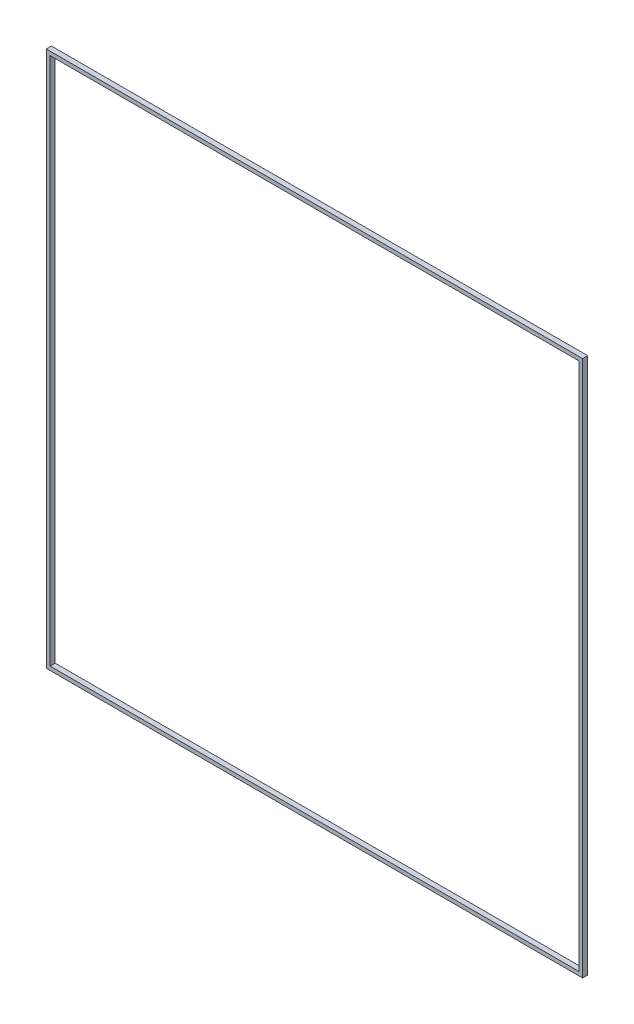
ISO-10303-21;
HEADER;
FILE_DESCRIPTION(('STEP AP214'),'2;1');
FILE_NAME('part.step','',(''),(''),'','','');
FILE_SCHEMA(('AUTOMOTIVE_DESIGN { 1 0 10303 214 1 1 1 1 }'));
ENDSEC;
DATA;
#1=APPLICATION_CONTEXT('core data for automotive mechanical design processes');
#2=APPLICATION_PROTOCOL_DEFINITION('international standard','automotive_design',2000,#1);
#3=PRODUCT_CONTEXT('',#1,'mechanical');
#4=PRODUCT('Part','Part','',(#3));
#5=PRODUCT_RELATED_PRODUCT_CATEGORY('part','',(#4));
#6=PRODUCT_DEFINITION_FORMATION('','',#4);
#7=PRODUCT_DEFINITION_CONTEXT('part definition',#1,'design');
#8=PRODUCT_DEFINITION('design','',#6,#7);
#9=PRODUCT_DEFINITION_SHAPE('','',#8);
#10=(LENGTH_UNIT() NAMED_UNIT(*) SI_UNIT(.MILLI.,.METRE.));
#11=(NAMED_UNIT(*) PLANE_ANGLE_UNIT() SI_UNIT($,.RADIAN.));
#12=(NAMED_UNIT(*) SI_UNIT($,.STERADIAN.) SOLID_ANGLE_UNIT());
#13=UNCERTAINTY_MEASURE_WITH_UNIT(LENGTH_MEASURE(1.E-05),#10,'distance_accuracy_value','');
#14=(GEOMETRIC_REPRESENTATION_CONTEXT(3) GLOBAL_UNCERTAINTY_ASSIGNED_CONTEXT((#13)) GLOBAL_UNIT_ASSIGNED_CONTEXT((#10,
#11,#12)) REPRESENTATION_CONTEXT('',''));
#15=CARTESIAN_POINT('',(0.,0.,0.));
#16=DIRECTION('',(0.,0.,1.));
#17=DIRECTION('',(1.,0.,0.));
#18=AXIS2_PLACEMENT_3D('',#15,#16,#17);
#19=CARTESIAN_POINT('',(0.,0.,2.));
#20=DIRECTION('',(0.,0.,-1.));
#21=DIRECTION('',(-1.,0.,0.));
#22=AXIS2_PLACEMENT_3D('',#19,#20,#21);
#23=PLANE('',#22);
#24=DIRECTION('',(0.,1.,0.));
#25=VECTOR('',#24,1.);
#26=CARTESIAN_POINT('',(105.,-105.,2.));
#27=LINE('',#26,#25);
#28=CARTESIAN_POINT('',(105.,-105.,2.));
#29=VERTEX_POINT('',#28);
#30=CARTESIAN_POINT('',(105.,105.,2.));
#31=VERTEX_POINT('',#30);
#32=EDGE_CURVE('E157',#29,#31,#27,.T.);
#33=ORIENTED_EDGE('',*,*,#32,.T.);
#34=DIRECTION('',(-1.,0.,0.));
#35=VECTOR('',#34,1.);
#36=CARTESIAN_POINT('',(-105.,105.,2.));
#37=LINE('',#36,#35);
#38=CARTESIAN_POINT('',(-105.,105.,2.));
#39=VERTEX_POINT('',#38);
#40=EDGE_CURVE('E161',#31,#39,#37,.T.);
#41=ORIENTED_EDGE('',*,*,#40,.T.);
#42=DIRECTION('',(0.,-1.,0.));
#43=VECTOR('',#42,1.);
#44=CARTESIAN_POINT('',(-105.,-105.,2.));
#45=LINE('',#44,#43);
#46=CARTESIAN_POINT('',(-105.,-105.,2.));
#47=VERTEX_POINT('',#46);
#48=EDGE_CURVE('E165',#39,#47,#45,.T.);
#49=ORIENTED_EDGE('',*,*,#48,.T.);
#50=DIRECTION('',(1.,0.,0.));
#51=VECTOR('',#50,1.);
#52=CARTESIAN_POINT('',(-105.,-105.,2.));
#53=LINE('',#52,#51);
#54=EDGE_CURVE('E168',#47,#29,#53,.T.);
#55=ORIENTED_EDGE('',*,*,#54,.T.);
#56=EDGE_LOOP('',(#33,#41,#49,#55));
#57=FACE_BOUND('',#56,.T.);
#58=DIRECTION('',(1.,0.,0.));
#59=VECTOR('',#58,1.);
#60=CARTESIAN_POINT('',(-103.5,103.5,2.));
#61=LINE('',#60,#59);
#62=CARTESIAN_POINT('',(-103.5,103.5,2.));
#63=VERTEX_POINT('',#62);
#64=CARTESIAN_POINT('',(103.5,103.5,2.));
#65=VERTEX_POINT('',#64);
#66=EDGE_CURVE('E59',#63,#65,#61,.T.);
#67=ORIENTED_EDGE('',*,*,#66,.T.);
#68=DIRECTION('',(0.,1.,0.));
#69=VECTOR('',#68,1.);
#70=CARTESIAN_POINT('',(103.5,-103.5,2.));
#71=LINE('',#70,#69);
#72=CARTESIAN_POINT('',(103.5,-103.5,2.));
#73=VERTEX_POINT('',#72);
#74=EDGE_CURVE('E125',#73,#65,#71,.T.);
#75=ORIENTED_EDGE('',*,*,#74,.F.);
#76=DIRECTION('',(1.,0.,0.));
#77=VECTOR('',#76,1.);
#78=CARTESIAN_POINT('',(-103.5,-103.5,2.));
#79=LINE('',#78,#77);
#80=CARTESIAN_POINT('',(-103.5,-103.5,2.));
#81=VERTEX_POINT('',#80);
#82=EDGE_CURVE('E143',#81,#73,#79,.T.);
#83=ORIENTED_EDGE('',*,*,#82,.F.);
#84=DIRECTION('',(0.,1.,0.));
#85=VECTOR('',#84,1.);
#86=CARTESIAN_POINT('',(-103.5,-103.5,2.));
#87=LINE('',#86,#85);
#88=EDGE_CURVE('E119',#81,#63,#87,.T.);
#89=ORIENTED_EDGE('',*,*,#88,.T.);
#90=EDGE_LOOP('',(#67,#75,#83,#89));
#91=FACE_BOUND('',#90,.T.);
#92=ADVANCED_FACE('F43',(#57,#91),#23,.F.);
#93=CARTESIAN_POINT('',(0.,0.,0.));
#94=DIRECTION('',(0.,0.,-1.));
#95=DIRECTION('',(-1.,0.,0.));
#96=AXIS2_PLACEMENT_3D('',#93,#94,#95);
#97=PLANE('',#96);
#98=DIRECTION('',(0.,1.,0.));
#99=VECTOR('',#98,1.);
#100=CARTESIAN_POINT('',(105.,-105.,0.));
#101=LINE('',#100,#99);
#102=CARTESIAN_POINT('',(105.,-105.,0.));
#103=VERTEX_POINT('',#102);
#104=CARTESIAN_POINT('',(105.,105.,0.));
#105=VERTEX_POINT('',#104);
#106=EDGE_CURVE('E127',#103,#105,#101,.T.);
#107=ORIENTED_EDGE('',*,*,#106,.F.);
#108=DIRECTION('',(1.,0.,0.));
#109=VECTOR('',#108,1.);
#110=CARTESIAN_POINT('',(-105.,-105.,0.));
#111=LINE('',#110,#109);
#112=CARTESIAN_POINT('',(-105.,-105.,0.));
#113=VERTEX_POINT('',#112);
#114=EDGE_CURVE('E162',#113,#103,#111,.T.);
#115=ORIENTED_EDGE('',*,*,#114,.F.);
#116=DIRECTION('',(0.,-1.,0.));
#117=VECTOR('',#116,1.);
#118=CARTESIAN_POINT('',(-105.,-105.,0.));
#119=LINE('',#118,#117);
#120=CARTESIAN_POINT('',(-105.,105.,0.));
#121=VERTEX_POINT('',#120);
#122=EDGE_CURVE('E178',#121,#113,#119,.T.);
#123=ORIENTED_EDGE('',*,*,#122,.F.);
#124=DIRECTION('',(-1.,0.,0.));
#125=VECTOR('',#124,1.);
#126=CARTESIAN_POINT('',(-105.,105.,0.));
#127=LINE('',#126,#125);
#128=EDGE_CURVE('E175',#105,#121,#127,.T.);
#129=ORIENTED_EDGE('',*,*,#128,.F.);
#130=EDGE_LOOP('',(#107,#115,#123,#129));
#131=FACE_BOUND('',#130,.T.);
#132=DIRECTION('',(0.,1.,0.));
#133=VECTOR('',#132,1.);
#134=CARTESIAN_POINT('',(103.5,-103.5,0.));
#135=LINE('',#134,#133);
#136=CARTESIAN_POINT('',(103.5,-103.5,0.));
#137=VERTEX_POINT('',#136);
#138=CARTESIAN_POINT('',(103.5,103.5,0.));
#139=VERTEX_POINT('',#138);
#140=EDGE_CURVE('E118',#137,#139,#135,.T.);
#141=ORIENTED_EDGE('',*,*,#140,.T.);
#142=DIRECTION('',(1.,0.,0.));
#143=VECTOR('',#142,1.);
#144=CARTESIAN_POINT('',(-103.5,103.5,0.));
#145=LINE('',#144,#143);
#146=CARTESIAN_POINT('',(-103.5,103.5,0.));
#147=VERTEX_POINT('',#146);
#148=EDGE_CURVE('E108',#147,#139,#145,.T.);
#149=ORIENTED_EDGE('',*,*,#148,.F.);
#150=DIRECTION('',(0.,1.,0.));
#151=VECTOR('',#150,1.);
#152=CARTESIAN_POINT('',(-103.5,-103.5,0.));
#153=LINE('',#152,#151);
#154=CARTESIAN_POINT('',(-103.5,-103.5,0.));
#155=VERTEX_POINT('',#154);
#156=EDGE_CURVE('E134',#155,#147,#153,.T.);
#157=ORIENTED_EDGE('',*,*,#156,.F.);
#158=DIRECTION('',(1.,0.,0.));
#159=VECTOR('',#158,1.);
#160=CARTESIAN_POINT('',(-103.5,-103.5,0.));
#161=LINE('',#160,#159);
#162=EDGE_CURVE('E67',#155,#137,#161,.T.);
#163=ORIENTED_EDGE('',*,*,#162,.T.);
#164=EDGE_LOOP('',(#141,#149,#157,#163));
#165=FACE_BOUND('',#164,.T.);
#166=ADVANCED_FACE('F130',(#131,#165),#97,.T.);
#167=CARTESIAN_POINT('',(105.,-105.,2.));
#168=DIRECTION('',(-1.,0.,0.));
#169=DIRECTION('',(0.,0.,1.));
#170=AXIS2_PLACEMENT_3D('',#167,#168,#169);
#171=PLANE('',#170);
#172=ORIENTED_EDGE('',*,*,#106,.T.);
#173=DIRECTION('',(0.,0.,-1.));
#174=VECTOR('',#173,1.);
#175=CARTESIAN_POINT('',(105.,105.,2.));
#176=LINE('',#175,#174);
#177=EDGE_CURVE('E11',#31,#105,#176,.T.);
#178=ORIENTED_EDGE('',*,*,#177,.F.);
#179=ORIENTED_EDGE('',*,*,#32,.F.);
#180=DIRECTION('',(0.,0.,-1.));
#181=VECTOR('',#180,1.);
#182=CARTESIAN_POINT('',(105.,-105.,2.));
#183=LINE('',#182,#181);
#184=EDGE_CURVE('E171',#29,#103,#183,.T.);
#185=ORIENTED_EDGE('',*,*,#184,.T.);
#186=EDGE_LOOP('',(#172,#178,#179,#185));
#187=FACE_BOUND('',#186,.T.);
#188=ADVANCED_FACE('F45',(#187),#171,.F.);
#189=CARTESIAN_POINT('',(-105.,105.,2.));
#190=DIRECTION('',(0.,-1.,0.));
#191=DIRECTION('',(0.,0.,-1.));
#192=AXIS2_PLACEMENT_3D('',#189,#190,#191);
#193=PLANE('',#192);
#194=ORIENTED_EDGE('',*,*,#128,.T.);
#195=DIRECTION('',(0.,0.,-1.));
#196=VECTOR('',#195,1.);
#197=CARTESIAN_POINT('',(-105.,105.,2.));
#198=LINE('',#197,#196);
#199=EDGE_CURVE('E52',#39,#121,#198,.T.);
#200=ORIENTED_EDGE('',*,*,#199,.F.);
#201=ORIENTED_EDGE('',*,*,#40,.F.);
#202=ORIENTED_EDGE('',*,*,#177,.T.);
#203=EDGE_LOOP('',(#194,#200,#201,#202));
#204=FACE_BOUND('',#203,.T.);
#205=ADVANCED_FACE('F210',(#204),#193,.F.);
#206=CARTESIAN_POINT('',(-105.,-105.,2.));
#207=DIRECTION('',(1.,0.,0.));
#208=DIRECTION('',(0.,0.,-1.));
#209=AXIS2_PLACEMENT_3D('',#206,#207,#208);
#210=PLANE('',#209);
#211=ORIENTED_EDGE('',*,*,#122,.T.);
#212=DIRECTION('',(0.,0.,-1.));
#213=VECTOR('',#212,1.);
#214=CARTESIAN_POINT('',(-105.,-105.,2.));
#215=LINE('',#214,#213);
#216=EDGE_CURVE('E186',#47,#113,#215,.T.);
#217=ORIENTED_EDGE('',*,*,#216,.F.);
#218=ORIENTED_EDGE('',*,*,#48,.F.);
#219=ORIENTED_EDGE('',*,*,#199,.T.);
#220=EDGE_LOOP('',(#211,#217,#218,#219));
#221=FACE_BOUND('',#220,.T.);
#222=ADVANCED_FACE('F195',(#221),#210,.F.);
#223=CARTESIAN_POINT('',(-105.,-105.,2.));
#224=DIRECTION('',(0.,1.,0.));
#225=DIRECTION('',(0.,0.,1.));
#226=AXIS2_PLACEMENT_3D('',#223,#224,#225);
#227=PLANE('',#226);
#228=ORIENTED_EDGE('',*,*,#114,.T.);
#229=ORIENTED_EDGE('',*,*,#184,.F.);
#230=ORIENTED_EDGE('',*,*,#54,.F.);
#231=ORIENTED_EDGE('',*,*,#216,.T.);
#232=EDGE_LOOP('',(#228,#229,#230,#231));
#233=FACE_BOUND('',#232,.T.);
#234=ADVANCED_FACE('F203',(#233),#227,.F.);
#235=CARTESIAN_POINT('',(-103.5,103.5,0.));
#236=DIRECTION('',(0.,-1.,0.));
#237=DIRECTION('',(0.,0.,-1.));
#238=AXIS2_PLACEMENT_3D('',#235,#236,#237);
#239=PLANE('',#238);
#240=ORIENTED_EDGE('',*,*,#66,.F.);
#241=DIRECTION('',(0.,0.,1.));
#242=VECTOR('',#241,1.);
#243=CARTESIAN_POINT('',(-103.5,103.5,0.));
#244=LINE('',#243,#242);
#245=EDGE_CURVE('E113',#147,#63,#244,.T.);
#246=ORIENTED_EDGE('',*,*,#245,.F.);
#247=ORIENTED_EDGE('',*,*,#148,.T.);
#248=DIRECTION('',(0.,0.,1.));
#249=VECTOR('',#248,1.);
#250=CARTESIAN_POINT('',(103.5,103.5,0.));
#251=LINE('',#250,#249);
#252=EDGE_CURVE('E111',#139,#65,#251,.T.);
#253=ORIENTED_EDGE('',*,*,#252,.T.);
#254=EDGE_LOOP('',(#240,#246,#247,#253));
#255=FACE_BOUND('',#254,.T.);
#256=ADVANCED_FACE('F110',(#255),#239,.T.);
#257=CARTESIAN_POINT('',(103.5,-103.5,0.));
#258=DIRECTION('',(1.,0.,0.));
#259=DIRECTION('',(0.,0.,-1.));
#260=AXIS2_PLACEMENT_3D('',#257,#258,#259);
#261=PLANE('',#260);
#262=ORIENTED_EDGE('',*,*,#74,.T.);
#263=ORIENTED_EDGE('',*,*,#252,.F.);
#264=ORIENTED_EDGE('',*,*,#140,.F.);
#265=DIRECTION('',(0.,0.,1.));
#266=VECTOR('',#265,1.);
#267=CARTESIAN_POINT('',(103.5,-103.5,0.));
#268=LINE('',#267,#266);
#269=EDGE_CURVE('E128',#137,#73,#268,.T.);
#270=ORIENTED_EDGE('',*,*,#269,.T.);
#271=EDGE_LOOP('',(#262,#263,#264,#270));
#272=FACE_BOUND('',#271,.T.);
#273=ADVANCED_FACE('F123',(#272),#261,.F.);
#274=CARTESIAN_POINT('',(-103.5,-103.5,0.));
#275=DIRECTION('',(0.,-1.,0.));
#276=DIRECTION('',(0.,0.,-1.));
#277=AXIS2_PLACEMENT_3D('',#274,#275,#276);
#278=PLANE('',#277);
#279=ORIENTED_EDGE('',*,*,#82,.T.);
#280=ORIENTED_EDGE('',*,*,#269,.F.);
#281=ORIENTED_EDGE('',*,*,#162,.F.);
#282=DIRECTION('',(0.,0.,1.));
#283=VECTOR('',#282,1.);
#284=CARTESIAN_POINT('',(-103.5,-103.5,0.));
#285=LINE('',#284,#283);
#286=EDGE_CURVE('E152',#155,#81,#285,.T.);
#287=ORIENTED_EDGE('',*,*,#286,.T.);
#288=EDGE_LOOP('',(#279,#280,#281,#287));
#289=FACE_BOUND('',#288,.T.);
#290=ADVANCED_FACE('F233',(#289),#278,.F.);
#291=CARTESIAN_POINT('',(-103.5,-103.5,0.));
#292=DIRECTION('',(1.,0.,0.));
#293=DIRECTION('',(0.,0.,-1.));
#294=AXIS2_PLACEMENT_3D('',#291,#292,#293);
#295=PLANE('',#294);
#296=ORIENTED_EDGE('',*,*,#88,.F.);
#297=ORIENTED_EDGE('',*,*,#286,.F.);
#298=ORIENTED_EDGE('',*,*,#156,.T.);
#299=ORIENTED_EDGE('',*,*,#245,.T.);
#300=EDGE_LOOP('',(#296,#297,#298,#299));
#301=FACE_BOUND('',#300,.T.);
#302=ADVANCED_FACE('F237',(#301),#295,.T.);
#303=CLOSED_SHELL('',(#92,#166,#188,#205,#222,#234,#256,#273,#290,#302));
#304=MANIFOLD_SOLID_BREP('B2',#303);
#305=ADVANCED_BREP_SHAPE_REPRESENTATION('',(#18,#304),#14);
#306=SHAPE_DEFINITION_REPRESENTATION(#9,#305);
ENDSEC;
END-ISO-10303-21;
